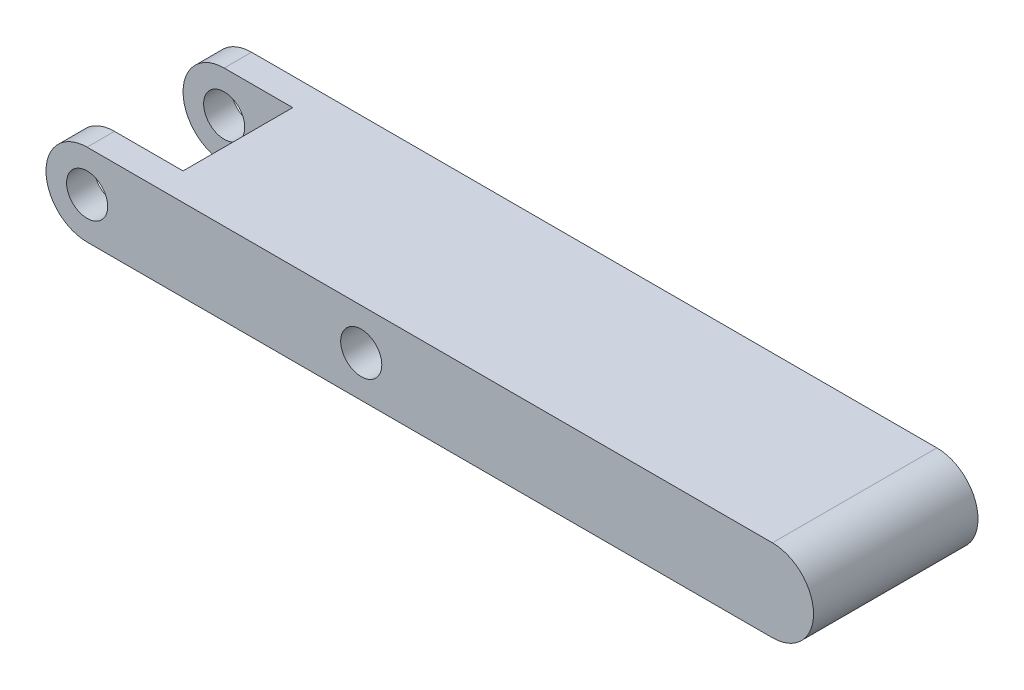
ISO-10303-21;
HEADER;
FILE_DESCRIPTION(('STEP AP214'),'2;1');
FILE_NAME('part.step','',(''),(''),'','','');
FILE_SCHEMA(('AUTOMOTIVE_DESIGN { 1 0 10303 214 1 1 1 1 }'));
ENDSEC;
DATA;
#1=APPLICATION_CONTEXT('core data for automotive mechanical design processes');
#2=APPLICATION_PROTOCOL_DEFINITION('international standard','automotive_design',2000,#1);
#3=PRODUCT_CONTEXT('',#1,'mechanical');
#4=PRODUCT('Part','Part','',(#3));
#5=PRODUCT_RELATED_PRODUCT_CATEGORY('part','',(#4));
#6=PRODUCT_DEFINITION_FORMATION('','',#4);
#7=PRODUCT_DEFINITION_CONTEXT('part definition',#1,'design');
#8=PRODUCT_DEFINITION('design','',#6,#7);
#9=PRODUCT_DEFINITION_SHAPE('','',#8);
#10=(LENGTH_UNIT() NAMED_UNIT(*) SI_UNIT(.MILLI.,.METRE.));
#11=(NAMED_UNIT(*) PLANE_ANGLE_UNIT() SI_UNIT($,.RADIAN.));
#12=(NAMED_UNIT(*) SI_UNIT($,.STERADIAN.) SOLID_ANGLE_UNIT());
#13=UNCERTAINTY_MEASURE_WITH_UNIT(LENGTH_MEASURE(1.E-05),#10,'distance_accuracy_value','');
#14=(GEOMETRIC_REPRESENTATION_CONTEXT(3) GLOBAL_UNCERTAINTY_ASSIGNED_CONTEXT((#13)) GLOBAL_UNIT_ASSIGNED_CONTEXT((#10,
#11,#12)) REPRESENTATION_CONTEXT('',''));
#15=CARTESIAN_POINT('',(0.,0.,0.));
#16=DIRECTION('',(0.,0.,1.));
#17=DIRECTION('',(1.,0.,0.));
#18=AXIS2_PLACEMENT_3D('',#15,#16,#17);
#19=CARTESIAN_POINT('',(-25.,0.,12.));
#20=DIRECTION('',(0.,0.,-1.));
#21=DIRECTION('',(-1.,0.,0.));
#22=AXIS2_PLACEMENT_3D('',#19,#20,#21);
#23=CYLINDRICAL_SURFACE('',#22,3.);
#24=CARTESIAN_POINT('',(-25.,0.,2.));
#25=DIRECTION('',(0.,0.,1.));
#26=DIRECTION('',(1.,0.,0.));
#27=AXIS2_PLACEMENT_3D('',#24,#25,#26);
#28=CIRCLE('',#27,3.);
#29=CARTESIAN_POINT('',(-25.,3.,2.));
#30=VERTEX_POINT('',#29);
#31=CARTESIAN_POINT('',(-25.,-3.,2.));
#32=VERTEX_POINT('',#31);
#33=EDGE_CURVE('E139',#30,#32,#28,.T.);
#34=ORIENTED_EDGE('',*,*,#33,.F.);
#35=DIRECTION('',(0.,0.,-1.));
#36=VECTOR('',#35,1.);
#37=CARTESIAN_POINT('',(-25.,3.,12.));
#38=LINE('',#37,#36);
#39=CARTESIAN_POINT('',(-25.,3.,0.));
#40=VERTEX_POINT('',#39);
#41=EDGE_CURVE('E81',#30,#40,#38,.T.);
#42=ORIENTED_EDGE('',*,*,#41,.T.);
#43=CARTESIAN_POINT('',(-25.,0.,0.));
#44=DIRECTION('',(0.,0.,1.));
#45=DIRECTION('',(1.,0.,0.));
#46=AXIS2_PLACEMENT_3D('',#43,#44,#45);
#47=CIRCLE('',#46,3.);
#48=CARTESIAN_POINT('',(-25.,-3.,0.));
#49=VERTEX_POINT('',#48);
#50=EDGE_CURVE('E152',#40,#49,#47,.T.);
#51=ORIENTED_EDGE('',*,*,#50,.T.);
#52=DIRECTION('',(0.,0.,-1.));
#53=VECTOR('',#52,1.);
#54=CARTESIAN_POINT('',(-25.,-3.,12.));
#55=LINE('',#54,#53);
#56=EDGE_CURVE('E42',#32,#49,#55,.T.);
#57=ORIENTED_EDGE('',*,*,#56,.F.);
#58=EDGE_LOOP('',(#34,#42,#51,#57));
#59=FACE_BOUND('',#58,.T.);
#60=ADVANCED_FACE('F33',(#59),#23,.T.);
#61=CARTESIAN_POINT('',(-25.,-3.,12.));
#62=DIRECTION('',(0.,1.,0.));
#63=DIRECTION('',(-1.,0.,0.));
#64=AXIS2_PLACEMENT_3D('',#61,#62,#63);
#65=PLANE('',#64);
#66=DIRECTION('',(1.,0.,0.));
#67=VECTOR('',#66,1.);
#68=CARTESIAN_POINT('',(-25.,-3.,2.));
#69=LINE('',#68,#67);
#70=CARTESIAN_POINT('',(-20.,-3.,2.));
#71=VERTEX_POINT('',#70);
#72=EDGE_CURVE('E137',#32,#71,#69,.T.);
#73=ORIENTED_EDGE('',*,*,#72,.F.);
#74=ORIENTED_EDGE('',*,*,#56,.T.);
#75=DIRECTION('',(1.,0.,0.));
#76=VECTOR('',#75,1.);
#77=CARTESIAN_POINT('',(-25.,-3.,0.));
#78=LINE('',#77,#76);
#79=CARTESIAN_POINT('',(25.,-2.99999999999999,0.));
#80=VERTEX_POINT('',#79);
#81=EDGE_CURVE('E163',#49,#80,#78,.T.);
#82=ORIENTED_EDGE('',*,*,#81,.T.);
#83=DIRECTION('',(0.,0.,-1.));
#84=VECTOR('',#83,1.);
#85=CARTESIAN_POINT('',(25.,-2.99999999999999,12.));
#86=LINE('',#85,#84);
#87=CARTESIAN_POINT('',(25.,-2.99999999999999,12.));
#88=VERTEX_POINT('',#87);
#89=EDGE_CURVE('E173',#88,#80,#86,.T.);
#90=ORIENTED_EDGE('',*,*,#89,.F.);
#91=DIRECTION('',(1.,0.,0.));
#92=VECTOR('',#91,1.);
#93=CARTESIAN_POINT('',(-25.,-3.,12.));
#94=LINE('',#93,#92);
#95=CARTESIAN_POINT('',(-25.,-3.,12.));
#96=VERTEX_POINT('',#95);
#97=EDGE_CURVE('E88',#96,#88,#94,.T.);
#98=ORIENTED_EDGE('',*,*,#97,.F.);
#99=CARTESIAN_POINT('',(-25.,-3.,10.));
#100=VERTEX_POINT('',#99);
#101=EDGE_CURVE('E11',#96,#100,#55,.T.);
#102=ORIENTED_EDGE('',*,*,#101,.T.);
#103=DIRECTION('',(1.,0.,0.));
#104=VECTOR('',#103,1.);
#105=CARTESIAN_POINT('',(-25.,-3.,10.));
#106=LINE('',#105,#104);
#107=CARTESIAN_POINT('',(-20.,-3.,10.));
#108=VERTEX_POINT('',#107);
#109=EDGE_CURVE('E134',#100,#108,#106,.T.);
#110=ORIENTED_EDGE('',*,*,#109,.T.);
#111=DIRECTION('',(0.,0.,1.));
#112=VECTOR('',#111,1.);
#113=CARTESIAN_POINT('',(-20.,-3.,12.));
#114=LINE('',#113,#112);
#115=EDGE_CURVE('E118',#71,#108,#114,.T.);
#116=ORIENTED_EDGE('',*,*,#115,.F.);
#117=EDGE_LOOP('',(#73,#74,#82,#90,#98,#102,#110,#116));
#118=FACE_BOUND('',#117,.T.);
#119=ADVANCED_FACE('F213',(#118),#65,.F.);
#120=CARTESIAN_POINT('',(-25.,3.,12.));
#121=DIRECTION('',(0.,-1.,0.));
#122=DIRECTION('',(1.,0.,0.));
#123=AXIS2_PLACEMENT_3D('',#120,#121,#122);
#124=PLANE('',#123);
#125=DIRECTION('',(1.,0.,0.));
#126=VECTOR('',#125,1.);
#127=CARTESIAN_POINT('',(-35.2635154057066,3.,2.));
#128=LINE('',#127,#126);
#129=CARTESIAN_POINT('',(-20.,3.,2.));
#130=VERTEX_POINT('',#129);
#131=EDGE_CURVE('E121',#30,#130,#128,.T.);
#132=ORIENTED_EDGE('',*,*,#131,.T.);
#133=DIRECTION('',(0.,0.,1.));
#134=VECTOR('',#133,1.);
#135=CARTESIAN_POINT('',(-20.,3.,2.));
#136=LINE('',#135,#134);
#137=CARTESIAN_POINT('',(-20.,3.,10.));
#138=VERTEX_POINT('',#137);
#139=EDGE_CURVE('E115',#130,#138,#136,.T.);
#140=ORIENTED_EDGE('',*,*,#139,.T.);
#141=DIRECTION('',(1.,0.,0.));
#142=VECTOR('',#141,1.);
#143=CARTESIAN_POINT('',(-35.2635154057066,3.,10.));
#144=LINE('',#143,#142);
#145=CARTESIAN_POINT('',(-25.,3.,10.));
#146=VERTEX_POINT('',#145);
#147=EDGE_CURVE('E123',#146,#138,#144,.T.);
#148=ORIENTED_EDGE('',*,*,#147,.F.);
#149=CARTESIAN_POINT('',(-25.,3.,12.));
#150=VERTEX_POINT('',#149);
#151=EDGE_CURVE('E168',#150,#146,#38,.T.);
#152=ORIENTED_EDGE('',*,*,#151,.F.);
#153=DIRECTION('',(-1.,0.,0.));
#154=VECTOR('',#153,1.);
#155=CARTESIAN_POINT('',(-25.,3.,12.));
#156=LINE('',#155,#154);
#157=CARTESIAN_POINT('',(25.,3.00000000000001,12.));
#158=VERTEX_POINT('',#157);
#159=EDGE_CURVE('E59',#158,#150,#156,.T.);
#160=ORIENTED_EDGE('',*,*,#159,.F.);
#161=DIRECTION('',(0.,0.,-1.));
#162=VECTOR('',#161,1.);
#163=CARTESIAN_POINT('',(25.,3.00000000000001,12.));
#164=LINE('',#163,#162);
#165=CARTESIAN_POINT('',(25.,3.00000000000001,0.));
#166=VERTEX_POINT('',#165);
#167=EDGE_CURVE('E170',#158,#166,#164,.T.);
#168=ORIENTED_EDGE('',*,*,#167,.T.);
#169=DIRECTION('',(-1.,0.,0.));
#170=VECTOR('',#169,1.);
#171=CARTESIAN_POINT('',(-25.,3.,0.));
#172=LINE('',#171,#170);
#173=EDGE_CURVE('E157',#166,#40,#172,.T.);
#174=ORIENTED_EDGE('',*,*,#173,.T.);
#175=ORIENTED_EDGE('',*,*,#41,.F.);
#176=EDGE_LOOP('',(#132,#140,#148,#152,#160,#168,#174,#175));
#177=FACE_BOUND('',#176,.T.);
#178=ADVANCED_FACE('F128',(#177),#124,.F.);
#179=CARTESIAN_POINT('',(-25.,0.,12.));
#180=DIRECTION('',(0.,0.,-1.));
#181=DIRECTION('',(-1.,0.,0.));
#182=AXIS2_PLACEMENT_3D('',#179,#180,#181);
#183=CYLINDRICAL_SURFACE('',#182,1.5);
#184=CARTESIAN_POINT('',(-25.,0.,0.));
#185=DIRECTION('',(0.,0.,1.));
#186=DIRECTION('',(1.,0.,0.));
#187=AXIS2_PLACEMENT_3D('',#184,#185,#186);
#188=CIRCLE('',#187,1.5);
#189=CARTESIAN_POINT('',(-23.5,0.,0.));
#190=VERTEX_POINT('',#189);
#191=EDGE_CURVE('E146',#190,#190,#188,.T.);
#192=ORIENTED_EDGE('',*,*,#191,.F.);
#193=EDGE_LOOP('',(#192));
#194=FACE_BOUND('',#193,.T.);
#195=CARTESIAN_POINT('',(-25.,0.,2.));
#196=DIRECTION('',(0.,0.,1.));
#197=DIRECTION('',(1.,0.,0.));
#198=AXIS2_PLACEMENT_3D('',#195,#196,#197);
#199=CIRCLE('',#198,1.5);
#200=CARTESIAN_POINT('',(-23.5,0.,2.));
#201=VERTEX_POINT('',#200);
#202=EDGE_CURVE('E37',#201,#201,#199,.T.);
#203=ORIENTED_EDGE('',*,*,#202,.T.);
#204=EDGE_LOOP('',(#203));
#205=FACE_BOUND('',#204,.T.);
#206=ADVANCED_FACE('F185',(#194,#205),#183,.F.);
#207=CARTESIAN_POINT('',(-25.,0.,12.));
#208=DIRECTION('',(0.,0.,1.));
#209=DIRECTION('',(1.,0.,0.));
#210=AXIS2_PLACEMENT_3D('',#207,#208,#209);
#211=PLANE('',#210);
#212=CARTESIAN_POINT('',(-25.,0.,12.));
#213=DIRECTION('',(0.,0.,1.));
#214=DIRECTION('',(1.,0.,0.));
#215=AXIS2_PLACEMENT_3D('',#212,#213,#214);
#216=CIRCLE('',#215,1.5);
#217=CARTESIAN_POINT('',(-23.5,0.,12.));
#218=VERTEX_POINT('',#217);
#219=EDGE_CURVE('E149',#218,#218,#216,.T.);
#220=ORIENTED_EDGE('',*,*,#219,.F.);
#221=EDGE_LOOP('',(#220));
#222=FACE_BOUND('',#221,.T.);
#223=CARTESIAN_POINT('',(-25.,0.,12.));
#224=DIRECTION('',(0.,0.,1.));
#225=DIRECTION('',(1.,0.,0.));
#226=AXIS2_PLACEMENT_3D('',#223,#224,#225);
#227=CIRCLE('',#226,3.);
#228=EDGE_CURVE('E155',#150,#96,#227,.T.);
#229=ORIENTED_EDGE('',*,*,#228,.T.);
#230=ORIENTED_EDGE('',*,*,#97,.T.);
#231=CARTESIAN_POINT('',(25.,0.,12.));
#232=DIRECTION('',(0.,0.,1.));
#233=DIRECTION('',(1.,0.,0.));
#234=AXIS2_PLACEMENT_3D('',#231,#232,#233);
#235=CIRCLE('',#234,3.);
#236=EDGE_CURVE('E159',#88,#158,#235,.T.);
#237=ORIENTED_EDGE('',*,*,#236,.T.);
#238=ORIENTED_EDGE('',*,*,#159,.T.);
#239=EDGE_LOOP('',(#229,#230,#237,#238));
#240=FACE_BOUND('',#239,.T.);
#241=CARTESIAN_POINT('',(-5.,0.,12.));
#242=DIRECTION('',(0.,0.,1.));
#243=DIRECTION('',(1.,0.,0.));
#244=AXIS2_PLACEMENT_3D('',#241,#242,#243);
#245=CIRCLE('',#244,1.5);
#246=CARTESIAN_POINT('',(-3.5,0.,12.));
#247=VERTEX_POINT('',#246);
#248=EDGE_CURVE('E143',#247,#247,#245,.T.);
#249=ORIENTED_EDGE('',*,*,#248,.F.);
#250=EDGE_LOOP('',(#249));
#251=FACE_BOUND('',#250,.T.);
#252=ADVANCED_FACE('F188',(#222,#240,#251),#211,.T.);
#253=CARTESIAN_POINT('',(-25.,0.,0.));
#254=DIRECTION('',(0.,0.,1.));
#255=DIRECTION('',(1.,0.,0.));
#256=AXIS2_PLACEMENT_3D('',#253,#254,#255);
#257=PLANE('',#256);
#258=ORIENTED_EDGE('',*,*,#50,.F.);
#259=ORIENTED_EDGE('',*,*,#173,.F.);
#260=CARTESIAN_POINT('',(25.,0.,0.));
#261=DIRECTION('',(0.,0.,1.));
#262=DIRECTION('',(1.,0.,0.));
#263=AXIS2_PLACEMENT_3D('',#260,#261,#262);
#264=CIRCLE('',#263,3.);
#265=EDGE_CURVE('E165',#80,#166,#264,.T.);
#266=ORIENTED_EDGE('',*,*,#265,.F.);
#267=ORIENTED_EDGE('',*,*,#81,.F.);
#268=EDGE_LOOP('',(#258,#259,#266,#267));
#269=FACE_BOUND('',#268,.T.);
#270=ORIENTED_EDGE('',*,*,#191,.T.);
#271=EDGE_LOOP('',(#270));
#272=FACE_BOUND('',#271,.T.);
#273=CARTESIAN_POINT('',(-5.,0.,0.));
#274=DIRECTION('',(0.,0.,1.));
#275=DIRECTION('',(1.,0.,0.));
#276=AXIS2_PLACEMENT_3D('',#273,#274,#275);
#277=CIRCLE('',#276,1.5);
#278=CARTESIAN_POINT('',(-3.5,0.,0.));
#279=VERTEX_POINT('',#278);
#280=EDGE_CURVE('E142',#279,#279,#277,.T.);
#281=ORIENTED_EDGE('',*,*,#280,.T.);
#282=EDGE_LOOP('',(#281));
#283=FACE_BOUND('',#282,.T.);
#284=ADVANCED_FACE('F190',(#269,#272,#283),#257,.F.);
#285=ORIENTED_EDGE('',*,*,#151,.T.);
#286=CARTESIAN_POINT('',(-25.,0.,10.));
#287=DIRECTION('',(0.,0.,1.));
#288=DIRECTION('',(1.,0.,0.));
#289=AXIS2_PLACEMENT_3D('',#286,#287,#288);
#290=CIRCLE('',#289,3.);
#291=EDGE_CURVE('E50',#146,#100,#290,.T.);
#292=ORIENTED_EDGE('',*,*,#291,.T.);
#293=ORIENTED_EDGE('',*,*,#101,.F.);
#294=ORIENTED_EDGE('',*,*,#228,.F.);
#295=EDGE_LOOP('',(#285,#292,#293,#294));
#296=FACE_BOUND('',#295,.T.);
#297=ADVANCED_FACE('F35',(#296),#23,.T.);
#298=CARTESIAN_POINT('',(25.,0.,12.));
#299=DIRECTION('',(0.,0.,-1.));
#300=DIRECTION('',(-1.,0.,0.));
#301=AXIS2_PLACEMENT_3D('',#298,#299,#300);
#302=CYLINDRICAL_SURFACE('',#301,3.);
#303=ORIENTED_EDGE('',*,*,#265,.T.);
#304=ORIENTED_EDGE('',*,*,#167,.F.);
#305=ORIENTED_EDGE('',*,*,#236,.F.);
#306=ORIENTED_EDGE('',*,*,#89,.T.);
#307=EDGE_LOOP('',(#303,#304,#305,#306));
#308=FACE_BOUND('',#307,.T.);
#309=ADVANCED_FACE('F183',(#308),#302,.T.);
#310=CARTESIAN_POINT('',(-25.,0.,10.));
#311=DIRECTION('',(0.,0.,1.));
#312=DIRECTION('',(1.,0.,0.));
#313=AXIS2_PLACEMENT_3D('',#310,#311,#312);
#314=CIRCLE('',#313,1.5);
#315=CARTESIAN_POINT('',(-23.5,0.,10.));
#316=VERTEX_POINT('',#315);
#317=EDGE_CURVE('E132',#316,#316,#314,.T.);
#318=ORIENTED_EDGE('',*,*,#317,.F.);
#319=EDGE_LOOP('',(#318));
#320=FACE_BOUND('',#319,.T.);
#321=ORIENTED_EDGE('',*,*,#219,.T.);
#322=EDGE_LOOP('',(#321));
#323=FACE_BOUND('',#322,.T.);
#324=ADVANCED_FACE('F179',(#320,#323),#183,.F.);
#325=CARTESIAN_POINT('',(-5.,0.,12.));
#326=DIRECTION('',(0.,0.,-1.));
#327=DIRECTION('',(-1.,0.,0.));
#328=AXIS2_PLACEMENT_3D('',#325,#326,#327);
#329=CYLINDRICAL_SURFACE('',#328,1.5);
#330=ORIENTED_EDGE('',*,*,#248,.T.);
#331=EDGE_LOOP('',(#330));
#332=FACE_BOUND('',#331,.T.);
#333=ORIENTED_EDGE('',*,*,#280,.F.);
#334=EDGE_LOOP('',(#333));
#335=FACE_BOUND('',#334,.T.);
#336=ADVANCED_FACE('F182',(#332,#335),#329,.F.);
#337=CARTESIAN_POINT('',(-20.,-7.,2.));
#338=DIRECTION('',(-1.,0.,0.));
#339=DIRECTION('',(0.,-1.,0.));
#340=AXIS2_PLACEMENT_3D('',#337,#338,#339);
#341=PLANE('',#340);
#342=ORIENTED_EDGE('',*,*,#115,.T.);
#343=DIRECTION('',(0.,1.,0.));
#344=VECTOR('',#343,1.);
#345=CARTESIAN_POINT('',(-20.,-7.,10.));
#346=LINE('',#345,#344);
#347=EDGE_CURVE('E111',#108,#138,#346,.T.);
#348=ORIENTED_EDGE('',*,*,#347,.T.);
#349=ORIENTED_EDGE('',*,*,#139,.F.);
#350=DIRECTION('',(0.,1.,0.));
#351=VECTOR('',#350,1.);
#352=CARTESIAN_POINT('',(-20.,-7.,2.));
#353=LINE('',#352,#351);
#354=EDGE_CURVE('E120',#71,#130,#353,.T.);
#355=ORIENTED_EDGE('',*,*,#354,.F.);
#356=EDGE_LOOP('',(#342,#348,#349,#355));
#357=FACE_BOUND('',#356,.T.);
#358=ADVANCED_FACE('F112',(#357),#341,.T.);
#359=CARTESIAN_POINT('',(-35.2635154057066,-7.,2.));
#360=DIRECTION('',(0.,0.,1.));
#361=DIRECTION('',(1.,0.,0.));
#362=AXIS2_PLACEMENT_3D('',#359,#360,#361);
#363=PLANE('',#362);
#364=ORIENTED_EDGE('',*,*,#202,.F.);
#365=EDGE_LOOP('',(#364));
#366=FACE_BOUND('',#365,.T.);
#367=ORIENTED_EDGE('',*,*,#33,.T.);
#368=ORIENTED_EDGE('',*,*,#72,.T.);
#369=ORIENTED_EDGE('',*,*,#354,.T.);
#370=ORIENTED_EDGE('',*,*,#131,.F.);
#371=EDGE_LOOP('',(#367,#368,#369,#370));
#372=FACE_BOUND('',#371,.T.);
#373=ADVANCED_FACE('F226',(#366,#372),#363,.T.);
#374=CARTESIAN_POINT('',(-35.2635154057066,-7.,10.));
#375=DIRECTION('',(0.,0.,1.));
#376=DIRECTION('',(1.,0.,0.));
#377=AXIS2_PLACEMENT_3D('',#374,#375,#376);
#378=PLANE('',#377);
#379=ORIENTED_EDGE('',*,*,#317,.T.);
#380=EDGE_LOOP('',(#379));
#381=FACE_BOUND('',#380,.T.);
#382=ORIENTED_EDGE('',*,*,#147,.T.);
#383=ORIENTED_EDGE('',*,*,#347,.F.);
#384=ORIENTED_EDGE('',*,*,#109,.F.);
#385=ORIENTED_EDGE('',*,*,#291,.F.);
#386=EDGE_LOOP('',(#382,#383,#384,#385));
#387=FACE_BOUND('',#386,.T.);
#388=ADVANCED_FACE('F124',(#381,#387),#378,.F.);
#389=CLOSED_SHELL('',(#60,#119,#178,#206,#252,#284,#297,#309,#324,#336,#358,#373,#388));
#390=MANIFOLD_SOLID_BREP('B2',#389);
#391=ADVANCED_BREP_SHAPE_REPRESENTATION('',(#18,#390),#14);
#392=SHAPE_DEFINITION_REPRESENTATION(#9,#391);
ENDSEC;
END-ISO-10303-21;
